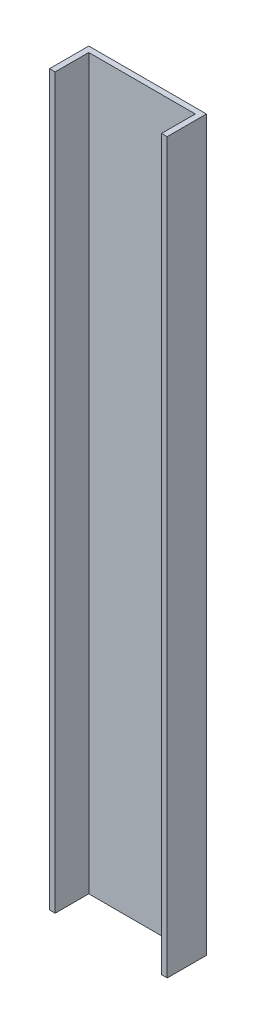
ISO-10303-21;
HEADER;
FILE_DESCRIPTION(('STEP AP214'),'2;1');
FILE_NAME('part.step','',(''),(''),'','','');
FILE_SCHEMA(('AUTOMOTIVE_DESIGN { 1 0 10303 214 1 1 1 1 }'));
ENDSEC;
DATA;
#1=APPLICATION_CONTEXT('core data for automotive mechanical design processes');
#2=APPLICATION_PROTOCOL_DEFINITION('international standard','automotive_design',2000,#1);
#3=PRODUCT_CONTEXT('',#1,'mechanical');
#4=PRODUCT('Part','Part','',(#3));
#5=PRODUCT_RELATED_PRODUCT_CATEGORY('part','',(#4));
#6=PRODUCT_DEFINITION_FORMATION('','',#4);
#7=PRODUCT_DEFINITION_CONTEXT('part definition',#1,'design');
#8=PRODUCT_DEFINITION('design','',#6,#7);
#9=PRODUCT_DEFINITION_SHAPE('','',#8);
#10=(LENGTH_UNIT() NAMED_UNIT(*) SI_UNIT(.MILLI.,.METRE.));
#11=(NAMED_UNIT(*) PLANE_ANGLE_UNIT() SI_UNIT($,.RADIAN.));
#12=(NAMED_UNIT(*) SI_UNIT($,.STERADIAN.) SOLID_ANGLE_UNIT());
#13=UNCERTAINTY_MEASURE_WITH_UNIT(LENGTH_MEASURE(1.E-05),#10,'distance_accuracy_value','');
#14=(GEOMETRIC_REPRESENTATION_CONTEXT(3) GLOBAL_UNCERTAINTY_ASSIGNED_CONTEXT((#13)) GLOBAL_UNIT_ASSIGNED_CONTEXT((#10,
#11,#12)) REPRESENTATION_CONTEXT('',''));
#15=CARTESIAN_POINT('',(0.,0.,0.));
#16=DIRECTION('',(0.,0.,1.));
#17=DIRECTION('',(1.,0.,0.));
#18=AXIS2_PLACEMENT_3D('',#15,#16,#17);
#19=CARTESIAN_POINT('',(200.,1050.,-70.));
#20=DIRECTION('',(0.,0.,-1.));
#21=DIRECTION('',(-1.,0.,0.));
#22=AXIS2_PLACEMENT_3D('',#19,#20,#21);
#23=PLANE('',#22);
#24=DIRECTION('',(-1.,0.,0.));
#25=VECTOR('',#24,1.);
#26=CARTESIAN_POINT('',(200.,2350.,-70.));
#27=LINE('',#26,#25);
#28=CARTESIAN_POINT('',(200.,2350.,-70.));
#29=VERTEX_POINT('',#28);
#30=CARTESIAN_POINT('',(-10.,2350.,-70.));
#31=VERTEX_POINT('',#30);
#32=EDGE_CURVE('E130',#29,#31,#27,.T.);
#33=ORIENTED_EDGE('',*,*,#32,.F.);
#34=DIRECTION('',(0.,1.,0.));
#35=VECTOR('',#34,1.);
#36=CARTESIAN_POINT('',(200.,1050.,-70.));
#37=LINE('',#36,#35);
#38=CARTESIAN_POINT('',(200.,1050.,-70.));
#39=VERTEX_POINT('',#38);
#40=EDGE_CURVE('E11',#39,#29,#37,.T.);
#41=ORIENTED_EDGE('',*,*,#40,.F.);
#42=DIRECTION('',(-1.,0.,0.));
#43=VECTOR('',#42,1.);
#44=CARTESIAN_POINT('',(200.,1050.,-70.));
#45=LINE('',#44,#43);
#46=CARTESIAN_POINT('',(-10.,1050.,-70.));
#47=VERTEX_POINT('',#46);
#48=EDGE_CURVE('E150',#39,#47,#45,.T.);
#49=ORIENTED_EDGE('',*,*,#48,.T.);
#50=DIRECTION('',(0.,1.,0.));
#51=VECTOR('',#50,1.);
#52=CARTESIAN_POINT('',(-10.,1050.,-70.));
#53=LINE('',#52,#51);
#54=EDGE_CURVE('E36',#47,#31,#53,.T.);
#55=ORIENTED_EDGE('',*,*,#54,.T.);
#56=EDGE_LOOP('',(#33,#41,#49,#55));
#57=FACE_BOUND('',#56,.T.);
#58=ADVANCED_FACE('F33',(#57),#23,.T.);
#59=CARTESIAN_POINT('',(200.,1050.,0.));
#60=DIRECTION('',(1.,0.,0.));
#61=DIRECTION('',(0.,0.,-1.));
#62=AXIS2_PLACEMENT_3D('',#59,#60,#61);
#63=PLANE('',#62);
#64=DIRECTION('',(0.,0.,-1.));
#65=VECTOR('',#64,1.);
#66=CARTESIAN_POINT('',(200.,2350.,0.));
#67=LINE('',#66,#65);
#68=CARTESIAN_POINT('',(200.,2350.,0.));
#69=VERTEX_POINT('',#68);
#70=EDGE_CURVE('E148',#69,#29,#67,.T.);
#71=ORIENTED_EDGE('',*,*,#70,.F.);
#72=DIRECTION('',(0.,1.,0.));
#73=VECTOR('',#72,1.);
#74=CARTESIAN_POINT('',(200.,1050.,0.));
#75=LINE('',#74,#73);
#76=CARTESIAN_POINT('',(200.,1050.,0.));
#77=VERTEX_POINT('',#76);
#78=EDGE_CURVE('E42',#77,#69,#75,.T.);
#79=ORIENTED_EDGE('',*,*,#78,.F.);
#80=DIRECTION('',(0.,0.,-1.));
#81=VECTOR('',#80,1.);
#82=CARTESIAN_POINT('',(200.,1050.,0.));
#83=LINE('',#82,#81);
#84=EDGE_CURVE('E120',#77,#39,#83,.T.);
#85=ORIENTED_EDGE('',*,*,#84,.T.);
#86=ORIENTED_EDGE('',*,*,#40,.T.);
#87=EDGE_LOOP('',(#71,#79,#85,#86));
#88=FACE_BOUND('',#87,.T.);
#89=ADVANCED_FACE('F162',(#88),#63,.T.);
#90=CARTESIAN_POINT('',(190.,1050.,0.));
#91=DIRECTION('',(0.,0.,1.));
#92=DIRECTION('',(1.,0.,0.));
#93=AXIS2_PLACEMENT_3D('',#90,#91,#92);
#94=PLANE('',#93);
#95=DIRECTION('',(1.,0.,0.));
#96=VECTOR('',#95,1.);
#97=CARTESIAN_POINT('',(190.,2350.,0.));
#98=LINE('',#97,#96);
#99=CARTESIAN_POINT('',(190.,2350.,0.));
#100=VERTEX_POINT('',#99);
#101=EDGE_CURVE('E107',#100,#69,#98,.T.);
#102=ORIENTED_EDGE('',*,*,#101,.F.);
#103=DIRECTION('',(0.,1.,0.));
#104=VECTOR('',#103,1.);
#105=CARTESIAN_POINT('',(190.,1050.,0.));
#106=LINE('',#105,#104);
#107=CARTESIAN_POINT('',(190.,1050.,0.));
#108=VERTEX_POINT('',#107);
#109=EDGE_CURVE('E102',#108,#100,#106,.T.);
#110=ORIENTED_EDGE('',*,*,#109,.F.);
#111=DIRECTION('',(1.,0.,0.));
#112=VECTOR('',#111,1.);
#113=CARTESIAN_POINT('',(190.,1050.,0.));
#114=LINE('',#113,#112);
#115=EDGE_CURVE('E105',#108,#77,#114,.T.);
#116=ORIENTED_EDGE('',*,*,#115,.T.);
#117=ORIENTED_EDGE('',*,*,#78,.T.);
#118=EDGE_LOOP('',(#102,#110,#116,#117));
#119=FACE_BOUND('',#118,.T.);
#120=ADVANCED_FACE('F104',(#119),#94,.T.);
#121=CARTESIAN_POINT('',(190.,1050.,-60.));
#122=DIRECTION('',(-1.,0.,0.));
#123=DIRECTION('',(0.,0.,1.));
#124=AXIS2_PLACEMENT_3D('',#121,#122,#123);
#125=PLANE('',#124);
#126=DIRECTION('',(0.,0.,1.));
#127=VECTOR('',#126,1.);
#128=CARTESIAN_POINT('',(190.,2350.,-60.));
#129=LINE('',#128,#127);
#130=CARTESIAN_POINT('',(190.,2350.,-60.));
#131=VERTEX_POINT('',#130);
#132=EDGE_CURVE('E145',#131,#100,#129,.T.);
#133=ORIENTED_EDGE('',*,*,#132,.F.);
#134=DIRECTION('',(0.,1.,0.));
#135=VECTOR('',#134,1.);
#136=CARTESIAN_POINT('',(190.,1050.,-60.));
#137=LINE('',#136,#135);
#138=CARTESIAN_POINT('',(190.,1050.,-60.));
#139=VERTEX_POINT('',#138);
#140=EDGE_CURVE('E112',#139,#131,#137,.T.);
#141=ORIENTED_EDGE('',*,*,#140,.F.);
#142=DIRECTION('',(0.,0.,1.));
#143=VECTOR('',#142,1.);
#144=CARTESIAN_POINT('',(190.,1050.,-60.));
#145=LINE('',#144,#143);
#146=EDGE_CURVE('E118',#139,#108,#145,.T.);
#147=ORIENTED_EDGE('',*,*,#146,.T.);
#148=ORIENTED_EDGE('',*,*,#109,.T.);
#149=EDGE_LOOP('',(#133,#141,#147,#148));
#150=FACE_BOUND('',#149,.T.);
#151=ADVANCED_FACE('F122',(#150),#125,.T.);
#152=CARTESIAN_POINT('',(0.,1050.,-60.));
#153=DIRECTION('',(0.,0.,1.));
#154=DIRECTION('',(1.,0.,0.));
#155=AXIS2_PLACEMENT_3D('',#152,#153,#154);
#156=PLANE('',#155);
#157=DIRECTION('',(1.,0.,0.));
#158=VECTOR('',#157,1.);
#159=CARTESIAN_POINT('',(0.,2350.,-60.));
#160=LINE('',#159,#158);
#161=CARTESIAN_POINT('',(0.,2350.,-60.));
#162=VERTEX_POINT('',#161);
#163=EDGE_CURVE('E142',#162,#131,#160,.T.);
#164=ORIENTED_EDGE('',*,*,#163,.F.);
#165=DIRECTION('',(0.,1.,0.));
#166=VECTOR('',#165,1.);
#167=CARTESIAN_POINT('',(0.,1050.,-60.));
#168=LINE('',#167,#166);
#169=CARTESIAN_POINT('',(0.,1050.,-60.));
#170=VERTEX_POINT('',#169);
#171=EDGE_CURVE('E154',#170,#162,#168,.T.);
#172=ORIENTED_EDGE('',*,*,#171,.F.);
#173=DIRECTION('',(1.,0.,0.));
#174=VECTOR('',#173,1.);
#175=CARTESIAN_POINT('',(0.,1050.,-60.));
#176=LINE('',#175,#174);
#177=EDGE_CURVE('E123',#170,#139,#176,.T.);
#178=ORIENTED_EDGE('',*,*,#177,.T.);
#179=ORIENTED_EDGE('',*,*,#140,.T.);
#180=EDGE_LOOP('',(#164,#172,#178,#179));
#181=FACE_BOUND('',#180,.T.);
#182=ADVANCED_FACE('F175',(#181),#156,.T.);
#183=CARTESIAN_POINT('',(0.,1050.,0.));
#184=DIRECTION('',(1.,0.,0.));
#185=DIRECTION('',(0.,0.,-1.));
#186=AXIS2_PLACEMENT_3D('',#183,#184,#185);
#187=PLANE('',#186);
#188=DIRECTION('',(0.,0.,-1.));
#189=VECTOR('',#188,1.);
#190=CARTESIAN_POINT('',(0.,2350.,0.));
#191=LINE('',#190,#189);
#192=CARTESIAN_POINT('',(0.,2350.,0.));
#193=VERTEX_POINT('',#192);
#194=EDGE_CURVE('E139',#193,#162,#191,.T.);
#195=ORIENTED_EDGE('',*,*,#194,.F.);
#196=DIRECTION('',(0.,1.,0.));
#197=VECTOR('',#196,1.);
#198=CARTESIAN_POINT('',(0.,1050.,0.));
#199=LINE('',#198,#197);
#200=CARTESIAN_POINT('',(0.,1050.,0.));
#201=VERTEX_POINT('',#200);
#202=EDGE_CURVE('E156',#201,#193,#199,.T.);
#203=ORIENTED_EDGE('',*,*,#202,.F.);
#204=DIRECTION('',(0.,0.,-1.));
#205=VECTOR('',#204,1.);
#206=CARTESIAN_POINT('',(0.,1050.,0.));
#207=LINE('',#206,#205);
#208=EDGE_CURVE('E125',#201,#170,#207,.T.);
#209=ORIENTED_EDGE('',*,*,#208,.T.);
#210=ORIENTED_EDGE('',*,*,#171,.T.);
#211=EDGE_LOOP('',(#195,#203,#209,#210));
#212=FACE_BOUND('',#211,.T.);
#213=ADVANCED_FACE('F178',(#212),#187,.T.);
#214=CARTESIAN_POINT('',(-10.,1050.,0.));
#215=DIRECTION('',(0.,0.,1.));
#216=DIRECTION('',(1.,0.,0.));
#217=AXIS2_PLACEMENT_3D('',#214,#215,#216);
#218=PLANE('',#217);
#219=DIRECTION('',(1.,0.,0.));
#220=VECTOR('',#219,1.);
#221=CARTESIAN_POINT('',(-10.,2350.,0.));
#222=LINE('',#221,#220);
#223=CARTESIAN_POINT('',(-10.,2350.,0.));
#224=VERTEX_POINT('',#223);
#225=EDGE_CURVE('E136',#224,#193,#222,.T.);
#226=ORIENTED_EDGE('',*,*,#225,.F.);
#227=DIRECTION('',(0.,1.,0.));
#228=VECTOR('',#227,1.);
#229=CARTESIAN_POINT('',(-10.,1050.,0.));
#230=LINE('',#229,#228);
#231=CARTESIAN_POINT('',(-10.,1050.,0.));
#232=VERTEX_POINT('',#231);
#233=EDGE_CURVE('E157',#232,#224,#230,.T.);
#234=ORIENTED_EDGE('',*,*,#233,.F.);
#235=DIRECTION('',(1.,0.,0.));
#236=VECTOR('',#235,1.);
#237=CARTESIAN_POINT('',(-10.,1050.,0.));
#238=LINE('',#237,#236);
#239=EDGE_CURVE('E253',#232,#201,#238,.T.);
#240=ORIENTED_EDGE('',*,*,#239,.T.);
#241=ORIENTED_EDGE('',*,*,#202,.T.);
#242=EDGE_LOOP('',(#226,#234,#240,#241));
#243=FACE_BOUND('',#242,.T.);
#244=ADVANCED_FACE('F182',(#243),#218,.T.);
#245=CARTESIAN_POINT('',(-10.,1050.,-70.));
#246=DIRECTION('',(-1.,0.,0.));
#247=DIRECTION('',(0.,0.,1.));
#248=AXIS2_PLACEMENT_3D('',#245,#246,#247);
#249=PLANE('',#248);
#250=DIRECTION('',(0.,0.,1.));
#251=VECTOR('',#250,1.);
#252=CARTESIAN_POINT('',(-10.,2350.,-70.));
#253=LINE('',#252,#251);
#254=EDGE_CURVE('E133',#31,#224,#253,.T.);
#255=ORIENTED_EDGE('',*,*,#254,.F.);
#256=ORIENTED_EDGE('',*,*,#54,.F.);
#257=DIRECTION('',(0.,0.,1.));
#258=VECTOR('',#257,1.);
#259=CARTESIAN_POINT('',(-10.,1050.,-70.));
#260=LINE('',#259,#258);
#261=EDGE_CURVE('E254',#47,#232,#260,.T.);
#262=ORIENTED_EDGE('',*,*,#261,.T.);
#263=ORIENTED_EDGE('',*,*,#233,.T.);
#264=EDGE_LOOP('',(#255,#256,#262,#263));
#265=FACE_BOUND('',#264,.T.);
#266=ADVANCED_FACE('F159',(#265),#249,.T.);
#267=CARTESIAN_POINT('',(0.,1050.,0.));
#268=DIRECTION('',(0.,1.,0.));
#269=DIRECTION('',(0.,0.,1.));
#270=AXIS2_PLACEMENT_3D('',#267,#268,#269);
#271=PLANE('',#270);
#272=ORIENTED_EDGE('',*,*,#48,.F.);
#273=ORIENTED_EDGE('',*,*,#84,.F.);
#274=ORIENTED_EDGE('',*,*,#115,.F.);
#275=ORIENTED_EDGE('',*,*,#146,.F.);
#276=ORIENTED_EDGE('',*,*,#177,.F.);
#277=ORIENTED_EDGE('',*,*,#208,.F.);
#278=ORIENTED_EDGE('',*,*,#239,.F.);
#279=ORIENTED_EDGE('',*,*,#261,.F.);
#280=EDGE_LOOP('',(#272,#273,#274,#275,#276,#277,#278,#279));
#281=FACE_BOUND('',#280,.T.);
#282=ADVANCED_FACE('F116',(#281),#271,.F.);
#283=CARTESIAN_POINT('',(0.,2350.,0.));
#284=DIRECTION('',(0.,1.,0.));
#285=DIRECTION('',(0.,0.,1.));
#286=AXIS2_PLACEMENT_3D('',#283,#284,#285);
#287=PLANE('',#286);
#288=ORIENTED_EDGE('',*,*,#32,.T.);
#289=ORIENTED_EDGE('',*,*,#254,.T.);
#290=ORIENTED_EDGE('',*,*,#225,.T.);
#291=ORIENTED_EDGE('',*,*,#194,.T.);
#292=ORIENTED_EDGE('',*,*,#163,.T.);
#293=ORIENTED_EDGE('',*,*,#132,.T.);
#294=ORIENTED_EDGE('',*,*,#101,.T.);
#295=ORIENTED_EDGE('',*,*,#70,.T.);
#296=EDGE_LOOP('',(#288,#289,#290,#291,#292,#293,#294,#295));
#297=FACE_BOUND('',#296,.T.);
#298=ADVANCED_FACE('F161',(#297),#287,.T.);
#299=CLOSED_SHELL('',(#58,#89,#120,#151,#182,#213,#244,#266,#282,#298));
#300=MANIFOLD_SOLID_BREP('B2',#299);
#301=ADVANCED_BREP_SHAPE_REPRESENTATION('',(#18,#300),#14);
#302=SHAPE_DEFINITION_REPRESENTATION(#9,#301);
ENDSEC;
END-ISO-10303-21;
